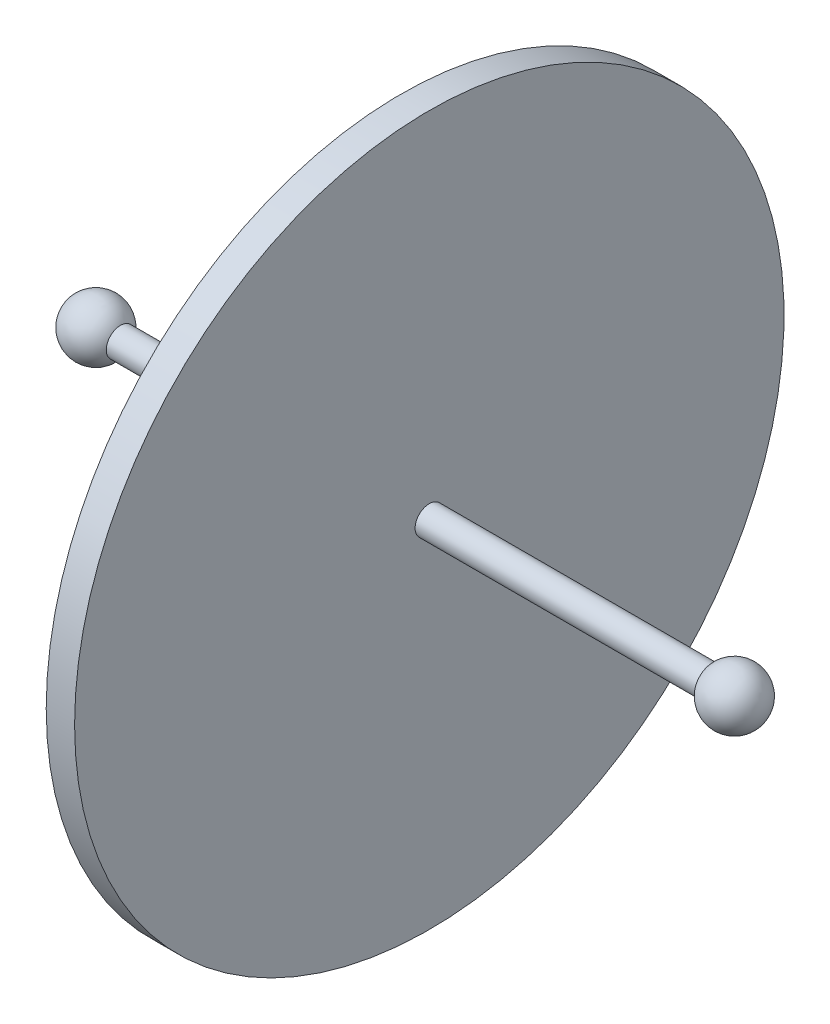
ISO-10303-21;
HEADER;
FILE_DESCRIPTION(('STEP AP214'),'2;1');
FILE_NAME('part.step','',(''),(''),'','','');
FILE_SCHEMA(('AUTOMOTIVE_DESIGN { 1 0 10303 214 1 1 1 1 }'));
ENDSEC;
DATA;
#1=APPLICATION_CONTEXT('core data for automotive mechanical design processes');
#2=APPLICATION_PROTOCOL_DEFINITION('international standard','automotive_design',2000,#1);
#3=PRODUCT_CONTEXT('',#1,'mechanical');
#4=PRODUCT('Part','Part','',(#3));
#5=PRODUCT_RELATED_PRODUCT_CATEGORY('part','',(#4));
#6=PRODUCT_DEFINITION_FORMATION('','',#4);
#7=PRODUCT_DEFINITION_CONTEXT('part definition',#1,'design');
#8=PRODUCT_DEFINITION('design','',#6,#7);
#9=PRODUCT_DEFINITION_SHAPE('','',#8);
#10=(LENGTH_UNIT() NAMED_UNIT(*) SI_UNIT(.MILLI.,.METRE.));
#11=(NAMED_UNIT(*) PLANE_ANGLE_UNIT() SI_UNIT($,.RADIAN.));
#12=(NAMED_UNIT(*) SI_UNIT($,.STERADIAN.) SOLID_ANGLE_UNIT());
#13=UNCERTAINTY_MEASURE_WITH_UNIT(LENGTH_MEASURE(1.E-05),#10,'distance_accuracy_value','');
#14=(GEOMETRIC_REPRESENTATION_CONTEXT(3) GLOBAL_UNCERTAINTY_ASSIGNED_CONTEXT((#13)) GLOBAL_UNIT_ASSIGNED_CONTEXT((#10,
#11,#12)) REPRESENTATION_CONTEXT('',''));
#15=CARTESIAN_POINT('',(0.,0.,0.));
#16=DIRECTION('',(0.,0.,1.));
#17=DIRECTION('',(1.,0.,0.));
#18=AXIS2_PLACEMENT_3D('',#15,#16,#17);
#19=CARTESIAN_POINT('',(0.,0.,0.));
#20=DIRECTION('',(-1.,0.,0.));
#21=DIRECTION('',(0.,0.,1.));
#22=AXIS2_PLACEMENT_3D('',#19,#20,#21);
#23=CYLINDRICAL_SURFACE('',#22,50.);
#24=CARTESIAN_POINT('',(2.,0.,0.));
#25=DIRECTION('',(-1.,0.,0.));
#26=DIRECTION('',(0.,0.,1.));
#27=AXIS2_PLACEMENT_3D('',#24,#25,#26);
#28=CIRCLE('',#27,50.);
#29=CARTESIAN_POINT('',(2.,0.,50.));
#30=VERTEX_POINT('',#29);
#31=EDGE_CURVE('E10',#30,#30,#28,.T.);
#32=ORIENTED_EDGE('',*,*,#31,.T.);
#33=EDGE_LOOP('',(#32));
#34=FACE_BOUND('',#33,.T.);
#35=CARTESIAN_POINT('',(-2.,0.,0.));
#36=DIRECTION('',(-1.,0.,0.));
#37=DIRECTION('',(0.,0.,1.));
#38=AXIS2_PLACEMENT_3D('',#35,#36,#37);
#39=CIRCLE('',#38,50.);
#40=CARTESIAN_POINT('',(-2.,0.,50.));
#41=VERTEX_POINT('',#40);
#42=EDGE_CURVE('E47',#41,#41,#39,.T.);
#43=ORIENTED_EDGE('',*,*,#42,.F.);
#44=EDGE_LOOP('',(#43));
#45=FACE_BOUND('',#44,.T.);
#46=ADVANCED_FACE('F33',(#34,#45),#23,.T.);
#47=CARTESIAN_POINT('',(2.,50.,0.));
#48=DIRECTION('',(-1.,0.,0.));
#49=DIRECTION('',(0.,0.,1.));
#50=AXIS2_PLACEMENT_3D('',#47,#48,#49);
#51=PLANE('',#50);
#52=ORIENTED_EDGE('',*,*,#31,.F.);
#53=EDGE_LOOP('',(#52));
#54=FACE_BOUND('',#53,.T.);
#55=CARTESIAN_POINT('',(2.00000000000001,0.,0.));
#56=DIRECTION('',(-1.,0.,0.));
#57=DIRECTION('',(0.,0.,1.));
#58=AXIS2_PLACEMENT_3D('',#55,#56,#57);
#59=CIRCLE('',#58,2.);
#60=CARTESIAN_POINT('',(2.00000000000001,0.,2.));
#61=VERTEX_POINT('',#60);
#62=EDGE_CURVE('E39',#61,#61,#59,.T.);
#63=ORIENTED_EDGE('',*,*,#62,.T.);
#64=EDGE_LOOP('',(#63));
#65=FACE_BOUND('',#64,.T.);
#66=ADVANCED_FACE('F75',(#54,#65),#51,.F.);
#67=CARTESIAN_POINT('',(0.,0.,0.));
#68=DIRECTION('',(-1.,0.,0.));
#69=DIRECTION('',(0.,0.,1.));
#70=AXIS2_PLACEMENT_3D('',#67,#68,#69);
#71=CYLINDRICAL_SURFACE('',#70,2.);
#72=ORIENTED_EDGE('',*,*,#62,.F.);
#73=EDGE_LOOP('',(#72));
#74=FACE_BOUND('',#73,.T.);
#75=CARTESIAN_POINT('',(41.5358983848622,0.,0.));
#76=DIRECTION('',(-1.,0.,0.));
#77=DIRECTION('',(0.,0.,1.));
#78=AXIS2_PLACEMENT_3D('',#75,#76,#77);
#79=CIRCLE('',#78,2.);
#80=CARTESIAN_POINT('',(41.5358983848622,0.,2.));
#81=VERTEX_POINT('',#80);
#82=EDGE_CURVE('E43',#81,#81,#79,.T.);
#83=ORIENTED_EDGE('',*,*,#82,.T.);
#84=EDGE_LOOP('',(#83));
#85=FACE_BOUND('',#84,.T.);
#86=ADVANCED_FACE('F79',(#74,#85),#71,.T.);
#87=CARTESIAN_POINT('',(45.,0.,0.));
#88=DIRECTION('',(-1.,0.,0.));
#89=DIRECTION('',(0.,1.,0.));
#90=AXIS2_PLACEMENT_3D('',#87,#88,#89);
#91=SPHERICAL_SURFACE('',#90,4.);
#92=ORIENTED_EDGE('',*,*,#82,.F.);
#93=EDGE_LOOP('',(#92));
#94=FACE_BOUND('',#93,.T.);
#95=ADVANCED_FACE('F71',(#94),#91,.T.);
#96=CARTESIAN_POINT('',(-2.,50.,0.));
#97=DIRECTION('',(1.,0.,0.));
#98=DIRECTION('',(0.,0.,1.));
#99=AXIS2_PLACEMENT_3D('',#96,#97,#98);
#100=PLANE('',#99);
#101=ORIENTED_EDGE('',*,*,#42,.T.);
#102=EDGE_LOOP('',(#101));
#103=FACE_BOUND('',#102,.T.);
#104=CARTESIAN_POINT('',(-2.00000000000001,0.,0.));
#105=DIRECTION('',(-1.,0.,0.));
#106=DIRECTION('',(0.,0.,1.));
#107=AXIS2_PLACEMENT_3D('',#104,#105,#106);
#108=CIRCLE('',#107,2.);
#109=CARTESIAN_POINT('',(-2.00000000000001,0.,2.));
#110=VERTEX_POINT('',#109);
#111=EDGE_CURVE('E52',#110,#110,#108,.T.);
#112=ORIENTED_EDGE('',*,*,#111,.F.);
#113=EDGE_LOOP('',(#112));
#114=FACE_BOUND('',#113,.T.);
#115=ADVANCED_FACE('F63',(#103,#114),#100,.F.);
#116=CARTESIAN_POINT('',(0.,0.,0.));
#117=DIRECTION('',(1.,0.,0.));
#118=DIRECTION('',(0.,0.,1.));
#119=AXIS2_PLACEMENT_3D('',#116,#117,#118);
#120=CYLINDRICAL_SURFACE('',#119,2.);
#121=ORIENTED_EDGE('',*,*,#111,.T.);
#122=EDGE_LOOP('',(#121));
#123=FACE_BOUND('',#122,.T.);
#124=CARTESIAN_POINT('',(-41.5358983848622,0.,0.));
#125=DIRECTION('',(-1.,0.,0.));
#126=DIRECTION('',(0.,0.,1.));
#127=AXIS2_PLACEMENT_3D('',#124,#125,#126);
#128=CIRCLE('',#127,2.);
#129=CARTESIAN_POINT('',(-41.5358983848622,0.,2.));
#130=VERTEX_POINT('',#129);
#131=EDGE_CURVE('E55',#130,#130,#128,.T.);
#132=ORIENTED_EDGE('',*,*,#131,.F.);
#133=EDGE_LOOP('',(#132));
#134=FACE_BOUND('',#133,.T.);
#135=ADVANCED_FACE('F61',(#123,#134),#120,.T.);
#136=CARTESIAN_POINT('',(-45.,0.,0.));
#137=DIRECTION('',(1.,0.,0.));
#138=DIRECTION('',(0.,1.,0.));
#139=AXIS2_PLACEMENT_3D('',#136,#137,#138);
#140=SPHERICAL_SURFACE('',#139,4.);
#141=ORIENTED_EDGE('',*,*,#131,.T.);
#142=EDGE_LOOP('',(#141));
#143=FACE_BOUND('',#142,.T.);
#144=ADVANCED_FACE('F59',(#143),#140,.T.);
#145=CLOSED_SHELL('',(#46,#66,#86,#95,#115,#135,#144));
#146=MANIFOLD_SOLID_BREP('B2',#145);
#147=ADVANCED_BREP_SHAPE_REPRESENTATION('',(#18,#146),#14);
#148=SHAPE_DEFINITION_REPRESENTATION(#9,#147);
ENDSEC;
END-ISO-10303-21;
